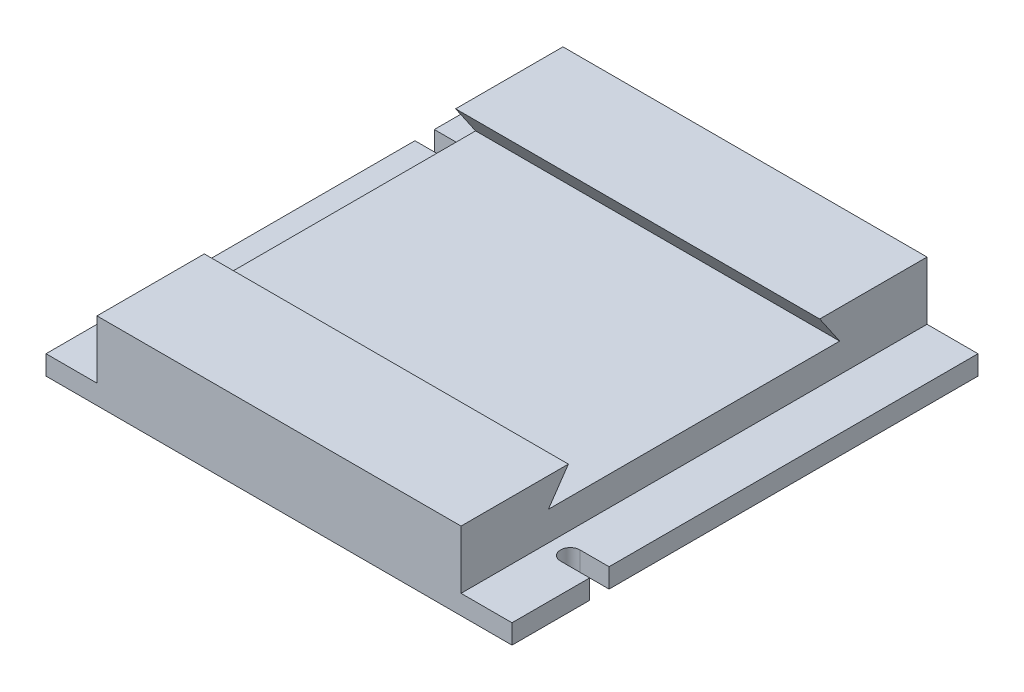
ISO-10303-21;
HEADER;
FILE_DESCRIPTION(('STEP AP214'),'2;1');
FILE_NAME('part.step','',(''),(''),'','','');
FILE_SCHEMA(('AUTOMOTIVE_DESIGN { 1 0 10303 214 1 1 1 1 }'));
ENDSEC;
DATA;
#1=APPLICATION_CONTEXT('core data for automotive mechanical design processes');
#2=APPLICATION_PROTOCOL_DEFINITION('international standard','automotive_design',2000,#1);
#3=PRODUCT_CONTEXT('',#1,'mechanical');
#4=PRODUCT('Part','Part','',(#3));
#5=PRODUCT_RELATED_PRODUCT_CATEGORY('part','',(#4));
#6=PRODUCT_DEFINITION_FORMATION('','',#4);
#7=PRODUCT_DEFINITION_CONTEXT('part definition',#1,'design');
#8=PRODUCT_DEFINITION('design','',#6,#7);
#9=PRODUCT_DEFINITION_SHAPE('','',#8);
#10=(LENGTH_UNIT() NAMED_UNIT(*) SI_UNIT(.MILLI.,.METRE.));
#11=(NAMED_UNIT(*) PLANE_ANGLE_UNIT() SI_UNIT($,.RADIAN.));
#12=(NAMED_UNIT(*) SI_UNIT($,.STERADIAN.) SOLID_ANGLE_UNIT());
#13=UNCERTAINTY_MEASURE_WITH_UNIT(LENGTH_MEASURE(1.E-05),#10,'distance_accuracy_value','');
#14=(GEOMETRIC_REPRESENTATION_CONTEXT(3) GLOBAL_UNCERTAINTY_ASSIGNED_CONTEXT((#13)) GLOBAL_UNIT_ASSIGNED_CONTEXT((#10,
#11,#12)) REPRESENTATION_CONTEXT('',''));
#15=CARTESIAN_POINT('',(0.,0.,0.));
#16=DIRECTION('',(0.,0.,1.));
#17=DIRECTION('',(1.,0.,0.));
#18=AXIS2_PLACEMENT_3D('',#15,#16,#17);
#19=CARTESIAN_POINT('',(240.,0.,0.));
#20=DIRECTION('',(1.,0.,0.));
#21=DIRECTION('',(0.,0.,-1.));
#22=AXIS2_PLACEMENT_3D('',#19,#20,#21);
#23=PLANE('',#22);
#24=DIRECTION('',(0.,-1.,0.));
#25=VECTOR('',#24,1.);
#26=CARTESIAN_POINT('',(240.,40.,80.000000000121));
#27=LINE('',#26,#25);
#28=CARTESIAN_POINT('',(240.,10.,80.000000000121));
#29=VERTEX_POINT('',#28);
#30=CARTESIAN_POINT('',(240.,0.,80.000000000121));
#31=VERTEX_POINT('',#30);
#32=EDGE_CURVE('E200',#29,#31,#27,.T.);
#33=ORIENTED_EDGE('',*,*,#32,.F.);
#34=DIRECTION('',(0.,0.,-1.));
#35=VECTOR('',#34,1.);
#36=CARTESIAN_POINT('',(240.,10.,-120.));
#37=LINE('',#36,#35);
#38=CARTESIAN_POINT('',(240.,10.,120.));
#39=VERTEX_POINT('',#38);
#40=EDGE_CURVE('E56',#39,#29,#37,.T.);
#41=ORIENTED_EDGE('',*,*,#40,.F.);
#42=DIRECTION('',(0.,-1.,0.));
#43=VECTOR('',#42,1.);
#44=CARTESIAN_POINT('',(240.,0.,120.));
#45=LINE('',#44,#43);
#46=CARTESIAN_POINT('',(240.,0.,120.));
#47=VERTEX_POINT('',#46);
#48=EDGE_CURVE('E278',#39,#47,#45,.T.);
#49=ORIENTED_EDGE('',*,*,#48,.T.);
#50=DIRECTION('',(0.,0.,-1.));
#51=VECTOR('',#50,1.);
#52=CARTESIAN_POINT('',(240.,0.,120.));
#53=LINE('',#52,#51);
#54=EDGE_CURVE('E209',#47,#31,#53,.T.);
#55=ORIENTED_EDGE('',*,*,#54,.T.);
#56=EDGE_LOOP('',(#33,#41,#49,#55));
#57=FACE_BOUND('',#56,.T.);
#58=ADVANCED_FACE('F34',(#57),#23,.T.);
#59=DIRECTION('',(0.,1.,0.));
#60=VECTOR('',#59,1.);
#61=CARTESIAN_POINT('',(240.,0.,-120.));
#62=LINE('',#61,#60);
#63=CARTESIAN_POINT('',(240.,0.,-120.));
#64=VERTEX_POINT('',#63);
#65=CARTESIAN_POINT('',(240.,10.,-120.));
#66=VERTEX_POINT('',#65);
#67=EDGE_CURVE('E204',#64,#66,#62,.T.);
#68=ORIENTED_EDGE('',*,*,#67,.T.);
#69=CARTESIAN_POINT('',(240.,10.,70.000000000121));
#70=VERTEX_POINT('',#69);
#71=EDGE_CURVE('E316',#70,#66,#37,.T.);
#72=ORIENTED_EDGE('',*,*,#71,.F.);
#73=DIRECTION('',(0.,1.,0.));
#74=VECTOR('',#73,1.);
#75=CARTESIAN_POINT('',(240.,0.,70.000000000121));
#76=LINE('',#75,#74);
#77=CARTESIAN_POINT('',(240.,0.,70.000000000121));
#78=VERTEX_POINT('',#77);
#79=EDGE_CURVE('E230',#78,#70,#76,.T.);
#80=ORIENTED_EDGE('',*,*,#79,.F.);
#81=EDGE_CURVE('E279',#78,#64,#53,.T.);
#82=ORIENTED_EDGE('',*,*,#81,.T.);
#83=EDGE_LOOP('',(#68,#72,#80,#82));
#84=FACE_BOUND('',#83,.T.);
#85=ADVANCED_FACE('F287',(#84),#23,.T.);
#86=CARTESIAN_POINT('',(0.,0.,0.));
#87=DIRECTION('',(1.,0.,0.));
#88=DIRECTION('',(0.,0.,-1.));
#89=AXIS2_PLACEMENT_3D('',#86,#87,#88);
#90=PLANE('',#89);
#91=DIRECTION('',(0.,0.,1.));
#92=VECTOR('',#91,1.);
#93=CARTESIAN_POINT('',(0.,10.,-120.));
#94=LINE('',#93,#92);
#95=CARTESIAN_POINT('',(0.,10.,-120.));
#96=VERTEX_POINT('',#95);
#97=CARTESIAN_POINT('',(-7.21644966006352E-13,10.,-80.0000000001199));
#98=VERTEX_POINT('',#97);
#99=EDGE_CURVE('E48',#96,#98,#94,.T.);
#100=ORIENTED_EDGE('',*,*,#99,.F.);
#101=DIRECTION('',(0.,1.,0.));
#102=VECTOR('',#101,1.);
#103=CARTESIAN_POINT('',(0.,0.,-120.));
#104=LINE('',#103,#102);
#105=CARTESIAN_POINT('',(0.,0.,-120.));
#106=VERTEX_POINT('',#105);
#107=EDGE_CURVE('E196',#106,#96,#104,.T.);
#108=ORIENTED_EDGE('',*,*,#107,.F.);
#109=DIRECTION('',(0.,0.,-1.));
#110=VECTOR('',#109,1.);
#111=CARTESIAN_POINT('',(0.,0.,120.));
#112=LINE('',#111,#110);
#113=CARTESIAN_POINT('',(-7.21644966006352E-13,0.,-80.0000000001199));
#114=VERTEX_POINT('',#113);
#115=EDGE_CURVE('E195',#114,#106,#112,.T.);
#116=ORIENTED_EDGE('',*,*,#115,.F.);
#117=DIRECTION('',(0.,-1.,0.));
#118=VECTOR('',#117,1.);
#119=CARTESIAN_POINT('',(-7.21644966006352E-13,40.,-80.0000000001199));
#120=LINE('',#119,#118);
#121=EDGE_CURVE('E271',#98,#114,#120,.T.);
#122=ORIENTED_EDGE('',*,*,#121,.F.);
#123=EDGE_LOOP('',(#100,#108,#116,#122));
#124=FACE_BOUND('',#123,.T.);
#125=ADVANCED_FACE('F362',(#124),#90,.F.);
#126=CARTESIAN_POINT('',(0.,10.,-70.00000000012));
#127=VERTEX_POINT('',#126);
#128=CARTESIAN_POINT('',(0.,10.,120.));
#129=VERTEX_POINT('',#128);
#130=EDGE_CURVE('E169',#127,#129,#94,.T.);
#131=ORIENTED_EDGE('',*,*,#130,.F.);
#132=DIRECTION('',(0.,-1.,0.));
#133=VECTOR('',#132,1.);
#134=CARTESIAN_POINT('',(0.,0.,-70.00000000012));
#135=LINE('',#134,#133);
#136=CARTESIAN_POINT('',(0.,0.,-70.00000000012));
#137=VERTEX_POINT('',#136);
#138=EDGE_CURVE('E228',#127,#137,#135,.T.);
#139=ORIENTED_EDGE('',*,*,#138,.T.);
#140=CARTESIAN_POINT('',(0.,0.,120.));
#141=VERTEX_POINT('',#140);
#142=EDGE_CURVE('E194',#141,#137,#112,.T.);
#143=ORIENTED_EDGE('',*,*,#142,.F.);
#144=DIRECTION('',(0.,-1.,0.));
#145=VECTOR('',#144,1.);
#146=CARTESIAN_POINT('',(0.,0.,120.));
#147=LINE('',#146,#145);
#148=EDGE_CURVE('E186',#129,#141,#147,.T.);
#149=ORIENTED_EDGE('',*,*,#148,.F.);
#150=EDGE_LOOP('',(#131,#139,#143,#149));
#151=FACE_BOUND('',#150,.T.);
#152=ADVANCED_FACE('F192',(#151),#90,.F.);
#153=CARTESIAN_POINT('',(14.9999999999993,40.,-75.0000000001201));
#154=DIRECTION('',(0.,-1.,0.));
#155=DIRECTION('',(0.,0.,-1.));
#156=AXIS2_PLACEMENT_3D('',#153,#154,#155);
#157=CYLINDRICAL_SURFACE('',#156,4.99999999999998);
#158=CARTESIAN_POINT('',(14.9999999999993,10.,-75.0000000001201));
#159=DIRECTION('',(0.,1.,0.));
#160=DIRECTION('',(0.,0.,1.));
#161=AXIS2_PLACEMENT_3D('',#158,#159,#160);
#162=CIRCLE('',#161,4.99999999999998);
#163=CARTESIAN_POINT('',(14.9999999999993,10.,-80.0000000001201));
#164=VERTEX_POINT('',#163);
#165=CARTESIAN_POINT('',(14.9999999999993,10.,-70.0000000001201));
#166=VERTEX_POINT('',#165);
#167=EDGE_CURVE('E324',#164,#166,#162,.F.);
#168=ORIENTED_EDGE('',*,*,#167,.F.);
#169=DIRECTION('',(0.,-1.,0.));
#170=VECTOR('',#169,1.);
#171=CARTESIAN_POINT('',(14.9999999999993,40.,-80.0000000001201));
#172=LINE('',#171,#170);
#173=CARTESIAN_POINT('',(14.9999999999993,0.,-80.0000000001201));
#174=VERTEX_POINT('',#173);
#175=EDGE_CURVE('E270',#164,#174,#172,.T.);
#176=ORIENTED_EDGE('',*,*,#175,.T.);
#177=CARTESIAN_POINT('',(14.9999999999993,0.,-75.0000000001201));
#178=DIRECTION('',(0.,-1.,0.));
#179=DIRECTION('',(0.,0.,-1.));
#180=AXIS2_PLACEMENT_3D('',#177,#178,#179);
#181=CIRCLE('',#180,4.99999999999998);
#182=CARTESIAN_POINT('',(14.9999999999994,0.,-70.0000000001201));
#183=VERTEX_POINT('',#182);
#184=EDGE_CURVE('E263',#174,#183,#181,.T.);
#185=ORIENTED_EDGE('',*,*,#184,.T.);
#186=DIRECTION('',(0.,-1.,0.));
#187=VECTOR('',#186,1.);
#188=CARTESIAN_POINT('',(14.9999999999994,40.,-70.0000000001201));
#189=LINE('',#188,#187);
#190=EDGE_CURVE('E273',#166,#183,#189,.T.);
#191=ORIENTED_EDGE('',*,*,#190,.F.);
#192=EDGE_LOOP('',(#168,#176,#185,#191));
#193=FACE_BOUND('',#192,.T.);
#194=ADVANCED_FACE('F419',(#193),#157,.F.);
#195=CARTESIAN_POINT('',(-6.3282712403634E-13,40.,-70.00000000012));
#196=DIRECTION('',(0.,0.,1.));
#197=DIRECTION('',(1.,0.,0.));
#198=AXIS2_PLACEMENT_3D('',#195,#196,#197);
#199=PLANE('',#198);
#200=DIRECTION('',(-1.,0.,0.));
#201=VECTOR('',#200,1.);
#202=CARTESIAN_POINT('',(-6.3282712403634E-13,10.,-70.00000000012));
#203=LINE('',#202,#201);
#204=EDGE_CURVE('E176',#166,#127,#203,.T.);
#205=ORIENTED_EDGE('',*,*,#204,.F.);
#206=ORIENTED_EDGE('',*,*,#190,.T.);
#207=DIRECTION('',(-1.,0.,0.));
#208=VECTOR('',#207,1.);
#209=CARTESIAN_POINT('',(-6.3282712403634E-13,0.,-70.00000000012));
#210=LINE('',#209,#208);
#211=EDGE_CURVE('E267',#183,#137,#210,.T.);
#212=ORIENTED_EDGE('',*,*,#211,.T.);
#213=ORIENTED_EDGE('',*,*,#138,.F.);
#214=EDGE_LOOP('',(#205,#206,#212,#213));
#215=FACE_BOUND('',#214,.T.);
#216=ADVANCED_FACE('F415',(#215),#199,.F.);
#217=CARTESIAN_POINT('',(14.9999999999993,40.,-80.0000000001201));
#218=DIRECTION('',(0.,0.,-1.));
#219=DIRECTION('',(-1.,0.,0.));
#220=AXIS2_PLACEMENT_3D('',#217,#218,#219);
#221=PLANE('',#220);
#222=DIRECTION('',(1.,0.,0.));
#223=VECTOR('',#222,1.);
#224=CARTESIAN_POINT('',(14.9999999999993,10.,-80.0000000001201));
#225=LINE('',#224,#223);
#226=EDGE_CURVE('E11',#98,#164,#225,.T.);
#227=ORIENTED_EDGE('',*,*,#226,.F.);
#228=ORIENTED_EDGE('',*,*,#121,.T.);
#229=DIRECTION('',(1.,0.,0.));
#230=VECTOR('',#229,1.);
#231=CARTESIAN_POINT('',(14.9999999999993,0.,-80.0000000001201));
#232=LINE('',#231,#230);
#233=EDGE_CURVE('E260',#114,#174,#232,.T.);
#234=ORIENTED_EDGE('',*,*,#233,.T.);
#235=ORIENTED_EDGE('',*,*,#175,.F.);
#236=EDGE_LOOP('',(#227,#228,#234,#235));
#237=FACE_BOUND('',#236,.T.);
#238=ADVANCED_FACE('F354',(#237),#221,.F.);
#239=CARTESIAN_POINT('',(225.,40.,75.000000000121));
#240=DIRECTION('',(0.,-1.,0.));
#241=DIRECTION('',(0.,0.,-1.));
#242=AXIS2_PLACEMENT_3D('',#239,#240,#241);
#243=CYLINDRICAL_SURFACE('',#242,4.99999999999999);
#244=CARTESIAN_POINT('',(225.,10.,75.000000000121));
#245=DIRECTION('',(0.,1.,0.));
#246=DIRECTION('',(0.,0.,1.));
#247=AXIS2_PLACEMENT_3D('',#244,#245,#246);
#248=CIRCLE('',#247,4.99999999999999);
#249=CARTESIAN_POINT('',(225.,10.,80.000000000121));
#250=VERTEX_POINT('',#249);
#251=CARTESIAN_POINT('',(225.,10.,70.000000000121));
#252=VERTEX_POINT('',#251);
#253=EDGE_CURVE('E234',#250,#252,#248,.F.);
#254=ORIENTED_EDGE('',*,*,#253,.F.);
#255=DIRECTION('',(0.,-1.,0.));
#256=VECTOR('',#255,1.);
#257=CARTESIAN_POINT('',(225.,40.,80.000000000121));
#258=LINE('',#257,#256);
#259=CARTESIAN_POINT('',(225.,0.,80.000000000121));
#260=VERTEX_POINT('',#259);
#261=EDGE_CURVE('E243',#250,#260,#258,.T.);
#262=ORIENTED_EDGE('',*,*,#261,.T.);
#263=CARTESIAN_POINT('',(225.,0.,75.000000000121));
#264=DIRECTION('',(0.,-1.,0.));
#265=DIRECTION('',(0.,0.,-1.));
#266=AXIS2_PLACEMENT_3D('',#263,#264,#265);
#267=CIRCLE('',#266,4.99999999999999);
#268=CARTESIAN_POINT('',(225.,0.,70.000000000121));
#269=VERTEX_POINT('',#268);
#270=EDGE_CURVE('E256',#260,#269,#267,.T.);
#271=ORIENTED_EDGE('',*,*,#270,.T.);
#272=DIRECTION('',(0.,-1.,0.));
#273=VECTOR('',#272,1.);
#274=CARTESIAN_POINT('',(225.,40.,70.000000000121));
#275=LINE('',#274,#273);
#276=EDGE_CURVE('E245',#252,#269,#275,.T.);
#277=ORIENTED_EDGE('',*,*,#276,.F.);
#278=EDGE_LOOP('',(#254,#262,#271,#277));
#279=FACE_BOUND('',#278,.T.);
#280=ADVANCED_FACE('F241',(#279),#243,.F.);
#281=CARTESIAN_POINT('',(240.,40.,70.000000000121));
#282=DIRECTION('',(0.,0.,-1.));
#283=DIRECTION('',(-1.,0.,0.));
#284=AXIS2_PLACEMENT_3D('',#281,#282,#283);
#285=PLANE('',#284);
#286=DIRECTION('',(1.,0.,0.));
#287=VECTOR('',#286,1.);
#288=CARTESIAN_POINT('',(240.,10.,70.000000000121));
#289=LINE('',#288,#287);
#290=EDGE_CURVE('E246',#252,#70,#289,.T.);
#291=ORIENTED_EDGE('',*,*,#290,.F.);
#292=ORIENTED_EDGE('',*,*,#276,.T.);
#293=DIRECTION('',(1.,0.,0.));
#294=VECTOR('',#293,1.);
#295=CARTESIAN_POINT('',(240.,0.,70.000000000121));
#296=LINE('',#295,#294);
#297=EDGE_CURVE('E253',#269,#78,#296,.T.);
#298=ORIENTED_EDGE('',*,*,#297,.T.);
#299=ORIENTED_EDGE('',*,*,#79,.T.);
#300=EDGE_LOOP('',(#291,#292,#298,#299));
#301=FACE_BOUND('',#300,.T.);
#302=ADVANCED_FACE('F346',(#301),#285,.F.);
#303=CARTESIAN_POINT('',(225.,40.,80.000000000121));
#304=DIRECTION('',(0.,0.,1.));
#305=DIRECTION('',(1.,0.,0.));
#306=AXIS2_PLACEMENT_3D('',#303,#304,#305);
#307=PLANE('',#306);
#308=DIRECTION('',(-1.,0.,0.));
#309=VECTOR('',#308,1.);
#310=CARTESIAN_POINT('',(225.,10.,80.000000000121));
#311=LINE('',#310,#309);
#312=EDGE_CURVE('E42',#29,#250,#311,.T.);
#313=ORIENTED_EDGE('',*,*,#312,.F.);
#314=ORIENTED_EDGE('',*,*,#32,.T.);
#315=DIRECTION('',(-1.,0.,0.));
#316=VECTOR('',#315,1.);
#317=CARTESIAN_POINT('',(225.,0.,80.000000000121));
#318=LINE('',#317,#316);
#319=EDGE_CURVE('E251',#31,#260,#318,.T.);
#320=ORIENTED_EDGE('',*,*,#319,.T.);
#321=ORIENTED_EDGE('',*,*,#261,.F.);
#322=EDGE_LOOP('',(#313,#314,#320,#321));
#323=FACE_BOUND('',#322,.T.);
#324=ADVANCED_FACE('F249',(#323),#307,.F.);
#325=CARTESIAN_POINT('',(240.,0.,-120.));
#326=DIRECTION('',(0.,0.,1.));
#327=DIRECTION('',(1.,0.,0.));
#328=AXIS2_PLACEMENT_3D('',#325,#326,#327);
#329=PLANE('',#328);
#330=DIRECTION('',(-1.,0.,0.));
#331=VECTOR('',#330,1.);
#332=CARTESIAN_POINT('',(0.,10.,-120.));
#333=LINE('',#332,#331);
#334=CARTESIAN_POINT('',(26.2452995157343,10.,-120.));
#335=VERTEX_POINT('',#334);
#336=EDGE_CURVE('E399',#335,#96,#333,.T.);
#337=ORIENTED_EDGE('',*,*,#336,.F.);
#338=DIRECTION('',(0.,1.,0.));
#339=VECTOR('',#338,1.);
#340=CARTESIAN_POINT('',(26.2452995157343,10.,-120.));
#341=LINE('',#340,#339);
#342=CARTESIAN_POINT('',(26.2452995157343,40.,-120.));
#343=VERTEX_POINT('',#342);
#344=EDGE_CURVE('E247',#335,#343,#341,.T.);
#345=ORIENTED_EDGE('',*,*,#344,.T.);
#346=DIRECTION('',(-1.,0.,0.));
#347=VECTOR('',#346,1.);
#348=CARTESIAN_POINT('',(240.,40.,-120.));
#349=LINE('',#348,#347);
#350=CARTESIAN_POINT('',(213.754700484266,40.,-120.));
#351=VERTEX_POINT('',#350);
#352=EDGE_CURVE('E225',#351,#343,#349,.T.);
#353=ORIENTED_EDGE('',*,*,#352,.F.);
#354=DIRECTION('',(0.,1.,0.));
#355=VECTOR('',#354,1.);
#356=CARTESIAN_POINT('',(213.754700484266,10.,-120.));
#357=LINE('',#356,#355);
#358=CARTESIAN_POINT('',(213.754700484266,10.,-120.));
#359=VERTEX_POINT('',#358);
#360=EDGE_CURVE('E303',#359,#351,#357,.T.);
#361=ORIENTED_EDGE('',*,*,#360,.F.);
#362=DIRECTION('',(-1.,0.,0.));
#363=VECTOR('',#362,1.);
#364=CARTESIAN_POINT('',(240.,10.,-120.));
#365=LINE('',#364,#363);
#366=EDGE_CURVE('E301',#66,#359,#365,.T.);
#367=ORIENTED_EDGE('',*,*,#366,.F.);
#368=ORIENTED_EDGE('',*,*,#67,.F.);
#369=DIRECTION('',(-1.,0.,0.));
#370=VECTOR('',#369,1.);
#371=CARTESIAN_POINT('',(240.,0.,-120.));
#372=LINE('',#371,#370);
#373=EDGE_CURVE('E205',#64,#106,#372,.T.);
#374=ORIENTED_EDGE('',*,*,#373,.T.);
#375=ORIENTED_EDGE('',*,*,#107,.T.);
#376=EDGE_LOOP('',(#337,#345,#353,#361,#367,#368,#374,#375));
#377=FACE_BOUND('',#376,.T.);
#378=ADVANCED_FACE('F36',(#377),#329,.F.);
#379=CARTESIAN_POINT('',(240.,40.,-120.));
#380=DIRECTION('',(0.,-1.,0.));
#381=DIRECTION('',(0.,0.,-1.));
#382=AXIS2_PLACEMENT_3D('',#379,#380,#381);
#383=PLANE('',#382);
#384=ORIENTED_EDGE('',*,*,#352,.T.);
#385=DIRECTION('',(0.,0.,-1.));
#386=VECTOR('',#385,1.);
#387=CARTESIAN_POINT('',(26.2452995157343,40.,-120.));
#388=LINE('',#387,#386);
#389=CARTESIAN_POINT('',(26.2452995157343,40.,-64.7199571199053));
#390=VERTEX_POINT('',#389);
#391=EDGE_CURVE('E321',#390,#343,#388,.T.);
#392=ORIENTED_EDGE('',*,*,#391,.F.);
#393=DIRECTION('',(-1.,0.,0.));
#394=VECTOR('',#393,1.);
#395=CARTESIAN_POINT('',(240.,40.,-64.7199571199053));
#396=LINE('',#395,#394);
#397=CARTESIAN_POINT('',(213.754700484266,40.,-64.7199571199053));
#398=VERTEX_POINT('',#397);
#399=EDGE_CURVE('E222',#398,#390,#396,.T.);
#400=ORIENTED_EDGE('',*,*,#399,.F.);
#401=DIRECTION('',(0.,0.,1.));
#402=VECTOR('',#401,1.);
#403=CARTESIAN_POINT('',(213.754700484266,40.,-120.));
#404=LINE('',#403,#402);
#405=EDGE_CURVE('E306',#351,#398,#404,.T.);
#406=ORIENTED_EDGE('',*,*,#405,.F.);
#407=EDGE_LOOP('',(#384,#392,#400,#406));
#408=FACE_BOUND('',#407,.T.);
#409=ADVANCED_FACE('F388',(#408),#383,.F.);
#410=CARTESIAN_POINT('',(240.,40.,-64.7199571199053));
#411=DIRECTION('',(0.,0.565316203180227,-0.824874287647453));
#412=DIRECTION('',(0.,0.824874287647453,0.565316203180227));
#413=AXIS2_PLACEMENT_3D('',#410,#411,#412);
#414=PLANE('',#413);
#415=ORIENTED_EDGE('',*,*,#399,.T.);
#416=DIRECTION('',(0.,-0.824874287647453,-0.565316203180227));
#417=VECTOR('',#416,1.);
#418=CARTESIAN_POINT('',(26.2452995157343,40.,-64.7199571199053));
#419=LINE('',#418,#417);
#420=CARTESIAN_POINT('',(26.2452995157343,25.,-75.));
#421=VERTEX_POINT('',#420);
#422=EDGE_CURVE('E264',#390,#421,#419,.T.);
#423=ORIENTED_EDGE('',*,*,#422,.T.);
#424=DIRECTION('',(-1.,0.,0.));
#425=VECTOR('',#424,1.);
#426=CARTESIAN_POINT('',(240.,25.,-75.));
#427=LINE('',#426,#425);
#428=CARTESIAN_POINT('',(213.754700484266,25.,-75.));
#429=VERTEX_POINT('',#428);
#430=EDGE_CURVE('E219',#429,#421,#427,.T.);
#431=ORIENTED_EDGE('',*,*,#430,.F.);
#432=DIRECTION('',(0.,0.824874287647453,0.565316203180227));
#433=VECTOR('',#432,1.);
#434=CARTESIAN_POINT('',(213.754700484266,40.,-64.7199571199053));
#435=LINE('',#434,#433);
#436=EDGE_CURVE('E333',#429,#398,#435,.T.);
#437=ORIENTED_EDGE('',*,*,#436,.T.);
#438=EDGE_LOOP('',(#415,#423,#431,#437));
#439=FACE_BOUND('',#438,.T.);
#440=ADVANCED_FACE('F385',(#439),#414,.F.);
#441=CARTESIAN_POINT('',(240.,25.,-75.));
#442=DIRECTION('',(0.,-1.,0.));
#443=DIRECTION('',(0.,0.,-1.));
#444=AXIS2_PLACEMENT_3D('',#441,#442,#443);
#445=PLANE('',#444);
#446=ORIENTED_EDGE('',*,*,#430,.T.);
#447=DIRECTION('',(0.,0.,1.));
#448=VECTOR('',#447,1.);
#449=CARTESIAN_POINT('',(26.2452995157343,25.,-75.));
#450=LINE('',#449,#448);
#451=CARTESIAN_POINT('',(26.2452995157343,25.,75.));
#452=VERTEX_POINT('',#451);
#453=EDGE_CURVE('E339',#421,#452,#450,.T.);
#454=ORIENTED_EDGE('',*,*,#453,.T.);
#455=DIRECTION('',(-1.,0.,0.));
#456=VECTOR('',#455,1.);
#457=CARTESIAN_POINT('',(240.,25.,75.));
#458=LINE('',#457,#456);
#459=CARTESIAN_POINT('',(213.754700484266,25.,75.));
#460=VERTEX_POINT('',#459);
#461=EDGE_CURVE('E216',#460,#452,#458,.T.);
#462=ORIENTED_EDGE('',*,*,#461,.F.);
#463=DIRECTION('',(0.,0.,-1.));
#464=VECTOR('',#463,1.);
#465=CARTESIAN_POINT('',(213.754700484266,25.,-75.));
#466=LINE('',#465,#464);
#467=EDGE_CURVE('E330',#460,#429,#466,.T.);
#468=ORIENTED_EDGE('',*,*,#467,.T.);
#469=EDGE_LOOP('',(#446,#454,#462,#468));
#470=FACE_BOUND('',#469,.T.);
#471=ADVANCED_FACE('F381',(#470),#445,.F.);
#472=CARTESIAN_POINT('',(240.,40.,64.7199571199053));
#473=DIRECTION('',(0.,0.565316203180227,0.824874287647453));
#474=DIRECTION('',(0.,-0.824874287647453,0.565316203180227));
#475=AXIS2_PLACEMENT_3D('',#472,#473,#474);
#476=PLANE('',#475);
#477=ORIENTED_EDGE('',*,*,#461,.T.);
#478=DIRECTION('',(0.,0.824874287647453,-0.565316203180227));
#479=VECTOR('',#478,1.);
#480=CARTESIAN_POINT('',(26.2452995157343,40.,64.7199571199053));
#481=LINE('',#480,#479);
#482=CARTESIAN_POINT('',(26.2452995157343,40.,64.7199571199053));
#483=VERTEX_POINT('',#482);
#484=EDGE_CURVE('E336',#452,#483,#481,.T.);
#485=ORIENTED_EDGE('',*,*,#484,.T.);
#486=DIRECTION('',(-1.,0.,0.));
#487=VECTOR('',#486,1.);
#488=CARTESIAN_POINT('',(240.,40.,64.7199571199053));
#489=LINE('',#488,#487);
#490=CARTESIAN_POINT('',(213.754700484266,40.,64.7199571199053));
#491=VERTEX_POINT('',#490);
#492=EDGE_CURVE('E213',#491,#483,#489,.T.);
#493=ORIENTED_EDGE('',*,*,#492,.F.);
#494=DIRECTION('',(0.,-0.824874287647453,0.565316203180227));
#495=VECTOR('',#494,1.);
#496=CARTESIAN_POINT('',(213.754700484266,40.,64.7199571199053));
#497=LINE('',#496,#495);
#498=EDGE_CURVE('E327',#491,#460,#497,.T.);
#499=ORIENTED_EDGE('',*,*,#498,.T.);
#500=EDGE_LOOP('',(#477,#485,#493,#499));
#501=FACE_BOUND('',#500,.T.);
#502=ADVANCED_FACE('F377',(#501),#476,.F.);
#503=CARTESIAN_POINT('',(240.,40.,120.));
#504=DIRECTION('',(0.,-1.,0.));
#505=DIRECTION('',(0.,0.,-1.));
#506=AXIS2_PLACEMENT_3D('',#503,#504,#505);
#507=PLANE('',#506);
#508=ORIENTED_EDGE('',*,*,#492,.T.);
#509=CARTESIAN_POINT('',(26.2452995157343,40.,120.));
#510=VERTEX_POINT('',#509);
#511=EDGE_CURVE('E180',#510,#483,#388,.T.);
#512=ORIENTED_EDGE('',*,*,#511,.F.);
#513=DIRECTION('',(-1.,0.,0.));
#514=VECTOR('',#513,1.);
#515=CARTESIAN_POINT('',(240.,40.,120.));
#516=LINE('',#515,#514);
#517=CARTESIAN_POINT('',(213.754700484266,40.,120.));
#518=VERTEX_POINT('',#517);
#519=EDGE_CURVE('E211',#518,#510,#516,.T.);
#520=ORIENTED_EDGE('',*,*,#519,.F.);
#521=EDGE_CURVE('E310',#491,#518,#404,.T.);
#522=ORIENTED_EDGE('',*,*,#521,.F.);
#523=EDGE_LOOP('',(#508,#512,#520,#522));
#524=FACE_BOUND('',#523,.T.);
#525=ADVANCED_FACE('F374',(#524),#507,.F.);
#526=CARTESIAN_POINT('',(240.,0.,120.));
#527=DIRECTION('',(0.,0.,-1.));
#528=DIRECTION('',(-1.,0.,0.));
#529=AXIS2_PLACEMENT_3D('',#526,#527,#528);
#530=PLANE('',#529);
#531=ORIENTED_EDGE('',*,*,#519,.T.);
#532=DIRECTION('',(0.,1.,0.));
#533=VECTOR('',#532,1.);
#534=CARTESIAN_POINT('',(26.2452995157343,10.,120.));
#535=LINE('',#534,#533);
#536=CARTESIAN_POINT('',(26.2452995157343,10.,120.));
#537=VERTEX_POINT('',#536);
#538=EDGE_CURVE('E188',#537,#510,#535,.T.);
#539=ORIENTED_EDGE('',*,*,#538,.F.);
#540=DIRECTION('',(1.,0.,0.));
#541=VECTOR('',#540,1.);
#542=CARTESIAN_POINT('',(0.,10.,120.));
#543=LINE('',#542,#541);
#544=EDGE_CURVE('E173',#129,#537,#543,.T.);
#545=ORIENTED_EDGE('',*,*,#544,.F.);
#546=ORIENTED_EDGE('',*,*,#148,.T.);
#547=DIRECTION('',(-1.,0.,0.));
#548=VECTOR('',#547,1.);
#549=CARTESIAN_POINT('',(240.,0.,120.));
#550=LINE('',#549,#548);
#551=EDGE_CURVE('E208',#47,#141,#550,.T.);
#552=ORIENTED_EDGE('',*,*,#551,.F.);
#553=ORIENTED_EDGE('',*,*,#48,.F.);
#554=DIRECTION('',(1.,0.,0.));
#555=VECTOR('',#554,1.);
#556=CARTESIAN_POINT('',(240.,10.,120.));
#557=LINE('',#556,#555);
#558=CARTESIAN_POINT('',(213.754700484266,10.,120.));
#559=VERTEX_POINT('',#558);
#560=EDGE_CURVE('E308',#559,#39,#557,.T.);
#561=ORIENTED_EDGE('',*,*,#560,.F.);
#562=DIRECTION('',(0.,1.,0.));
#563=VECTOR('',#562,1.);
#564=CARTESIAN_POINT('',(213.754700484266,10.,120.));
#565=LINE('',#564,#563);
#566=EDGE_CURVE('E318',#559,#518,#565,.T.);
#567=ORIENTED_EDGE('',*,*,#566,.T.);
#568=EDGE_LOOP('',(#531,#539,#545,#546,#552,#553,#561,#567));
#569=FACE_BOUND('',#568,.T.);
#570=ADVANCED_FACE('F184',(#569),#530,.F.);
#571=CARTESIAN_POINT('',(240.,0.,120.));
#572=DIRECTION('',(0.,1.,0.));
#573=DIRECTION('',(0.,0.,1.));
#574=AXIS2_PLACEMENT_3D('',#571,#572,#573);
#575=PLANE('',#574);
#576=ORIENTED_EDGE('',*,*,#270,.F.);
#577=ORIENTED_EDGE('',*,*,#319,.F.);
#578=ORIENTED_EDGE('',*,*,#54,.F.);
#579=ORIENTED_EDGE('',*,*,#551,.T.);
#580=ORIENTED_EDGE('',*,*,#142,.T.);
#581=ORIENTED_EDGE('',*,*,#211,.F.);
#582=ORIENTED_EDGE('',*,*,#184,.F.);
#583=ORIENTED_EDGE('',*,*,#233,.F.);
#584=ORIENTED_EDGE('',*,*,#115,.T.);
#585=ORIENTED_EDGE('',*,*,#373,.F.);
#586=ORIENTED_EDGE('',*,*,#81,.F.);
#587=ORIENTED_EDGE('',*,*,#297,.F.);
#588=EDGE_LOOP('',(#576,#577,#578,#579,#580,#581,#582,#583,#584,#585,#586,#587));
#589=FACE_BOUND('',#588,.T.);
#590=ADVANCED_FACE('F292',(#589),#575,.F.);
#591=CARTESIAN_POINT('',(213.754700484266,10.,-120.));
#592=DIRECTION('',(-1.,0.,0.));
#593=DIRECTION('',(0.,0.,1.));
#594=AXIS2_PLACEMENT_3D('',#591,#592,#593);
#595=PLANE('',#594);
#596=ORIENTED_EDGE('',*,*,#467,.F.);
#597=ORIENTED_EDGE('',*,*,#498,.F.);
#598=ORIENTED_EDGE('',*,*,#521,.T.);
#599=ORIENTED_EDGE('',*,*,#566,.F.);
#600=DIRECTION('',(0.,0.,1.));
#601=VECTOR('',#600,1.);
#602=CARTESIAN_POINT('',(213.754700484266,10.,-120.));
#603=LINE('',#602,#601);
#604=EDGE_CURVE('E305',#359,#559,#603,.T.);
#605=ORIENTED_EDGE('',*,*,#604,.F.);
#606=ORIENTED_EDGE('',*,*,#360,.T.);
#607=ORIENTED_EDGE('',*,*,#405,.T.);
#608=ORIENTED_EDGE('',*,*,#436,.F.);
#609=EDGE_LOOP('',(#596,#597,#598,#599,#605,#606,#607,#608));
#610=FACE_BOUND('',#609,.T.);
#611=ADVANCED_FACE('F371',(#610),#595,.F.);
#612=CARTESIAN_POINT('',(0.,10.,0.));
#613=DIRECTION('',(0.,1.,0.));
#614=DIRECTION('',(0.,0.,1.));
#615=AXIS2_PLACEMENT_3D('',#612,#613,#614);
#616=PLANE('',#615);
#617=ORIENTED_EDGE('',*,*,#290,.T.);
#618=ORIENTED_EDGE('',*,*,#71,.T.);
#619=ORIENTED_EDGE('',*,*,#366,.T.);
#620=ORIENTED_EDGE('',*,*,#604,.T.);
#621=ORIENTED_EDGE('',*,*,#560,.T.);
#622=ORIENTED_EDGE('',*,*,#40,.T.);
#623=ORIENTED_EDGE('',*,*,#312,.T.);
#624=ORIENTED_EDGE('',*,*,#253,.T.);
#625=EDGE_LOOP('',(#617,#618,#619,#620,#621,#622,#623,#624));
#626=FACE_BOUND('',#625,.T.);
#627=ADVANCED_FACE('F233',(#626),#616,.T.);
#628=CARTESIAN_POINT('',(26.2452995157343,10.,-120.));
#629=DIRECTION('',(1.,0.,0.));
#630=DIRECTION('',(0.,0.,-1.));
#631=AXIS2_PLACEMENT_3D('',#628,#629,#630);
#632=PLANE('',#631);
#633=ORIENTED_EDGE('',*,*,#391,.T.);
#634=ORIENTED_EDGE('',*,*,#344,.F.);
#635=DIRECTION('',(0.,0.,-1.));
#636=VECTOR('',#635,1.);
#637=CARTESIAN_POINT('',(26.2452995157343,10.,-120.));
#638=LINE('',#637,#636);
#639=EDGE_CURVE('E189',#537,#335,#638,.T.);
#640=ORIENTED_EDGE('',*,*,#639,.F.);
#641=ORIENTED_EDGE('',*,*,#538,.T.);
#642=ORIENTED_EDGE('',*,*,#511,.T.);
#643=ORIENTED_EDGE('',*,*,#484,.F.);
#644=ORIENTED_EDGE('',*,*,#453,.F.);
#645=ORIENTED_EDGE('',*,*,#422,.F.);
#646=EDGE_LOOP('',(#633,#634,#640,#641,#642,#643,#644,#645));
#647=FACE_BOUND('',#646,.T.);
#648=ADVANCED_FACE('F404',(#647),#632,.F.);
#649=CARTESIAN_POINT('',(0.,10.,0.));
#650=DIRECTION('',(0.,1.,0.));
#651=DIRECTION('',(0.,0.,1.));
#652=AXIS2_PLACEMENT_3D('',#649,#650,#651);
#653=PLANE('',#652);
#654=ORIENTED_EDGE('',*,*,#204,.T.);
#655=ORIENTED_EDGE('',*,*,#130,.T.);
#656=ORIENTED_EDGE('',*,*,#544,.T.);
#657=ORIENTED_EDGE('',*,*,#639,.T.);
#658=ORIENTED_EDGE('',*,*,#336,.T.);
#659=ORIENTED_EDGE('',*,*,#99,.T.);
#660=ORIENTED_EDGE('',*,*,#226,.T.);
#661=ORIENTED_EDGE('',*,*,#167,.T.);
#662=EDGE_LOOP('',(#654,#655,#656,#657,#658,#659,#660,#661));
#663=FACE_BOUND('',#662,.T.);
#664=ADVANCED_FACE('F171',(#663),#653,.T.);
#665=CLOSED_SHELL('',(#58,#85,#125,#152,#194,#216,#238,#280,#302,#324,#378,#409,#440,#471,#502,
#525,#570,#590,#611,#627,#648,#664));
#666=MANIFOLD_SOLID_BREP('B2',#665);
#667=ADVANCED_BREP_SHAPE_REPRESENTATION('',(#18,#666),#14);
#668=SHAPE_DEFINITION_REPRESENTATION(#9,#667);
ENDSEC;
END-ISO-10303-21;
